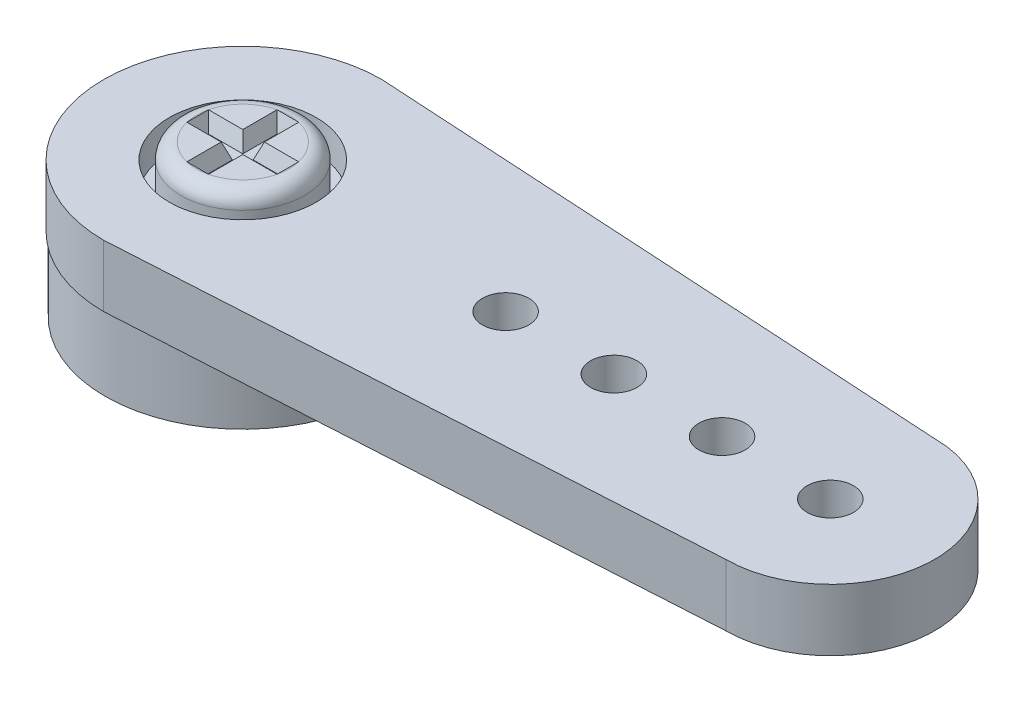
ISO-10303-21;
HEADER;
FILE_DESCRIPTION(('STEP AP214'),'2;1');
FILE_NAME('part.step','',(''),(''),'','','');
FILE_SCHEMA(('AUTOMOTIVE_DESIGN { 1 0 10303 214 1 1 1 1 }'));
ENDSEC;
DATA;
#1=APPLICATION_CONTEXT('core data for automotive mechanical design processes');
#2=APPLICATION_PROTOCOL_DEFINITION('international standard','automotive_design',2000,#1);
#3=PRODUCT_CONTEXT('',#1,'mechanical');
#4=PRODUCT('Part','Part','',(#3));
#5=PRODUCT_RELATED_PRODUCT_CATEGORY('part','',(#4));
#6=PRODUCT_DEFINITION_FORMATION('','',#4);
#7=PRODUCT_DEFINITION_CONTEXT('part definition',#1,'design');
#8=PRODUCT_DEFINITION('design','',#6,#7);
#9=PRODUCT_DEFINITION_SHAPE('','',#8);
#10=(LENGTH_UNIT() NAMED_UNIT(*) SI_UNIT(.MILLI.,.METRE.));
#11=(NAMED_UNIT(*) PLANE_ANGLE_UNIT() SI_UNIT($,.RADIAN.));
#12=(NAMED_UNIT(*) SI_UNIT($,.STERADIAN.) SOLID_ANGLE_UNIT());
#13=UNCERTAINTY_MEASURE_WITH_UNIT(LENGTH_MEASURE(1.E-05),#10,'distance_accuracy_value','');
#14=(GEOMETRIC_REPRESENTATION_CONTEXT(3) GLOBAL_UNCERTAINTY_ASSIGNED_CONTEXT((#13)) GLOBAL_UNIT_ASSIGNED_CONTEXT((#10,
#11,#12)) REPRESENTATION_CONTEXT('',''));
#15=CARTESIAN_POINT('',(0.,0.,0.));
#16=DIRECTION('',(0.,0.,1.));
#17=DIRECTION('',(1.,0.,0.));
#18=AXIS2_PLACEMENT_3D('',#15,#16,#17);
#19=CARTESIAN_POINT('',(0.,4.9,0.));
#20=DIRECTION('',(0.,1.,0.));
#21=DIRECTION('',(0.,0.,1.));
#22=AXIS2_PLACEMENT_3D('',#19,#20,#21);
#23=PLANE('',#22);
#24=DIRECTION('',(-1.,0.,0.));
#25=VECTOR('',#24,1.);
#26=CARTESIAN_POINT('',(1.45859521458148,4.9,-0.35));
#27=LINE('',#26,#25);
#28=CARTESIAN_POINT('',(1.45859521458148,4.9,-0.35));
#29=VERTEX_POINT('',#28);
#30=CARTESIAN_POINT('',(0.35,4.9,-0.35));
#31=VERTEX_POINT('',#30);
#32=EDGE_CURVE('E220',#29,#31,#27,.T.);
#33=ORIENTED_EDGE('',*,*,#32,.F.);
#34=CARTESIAN_POINT('',(0.,4.9,0.));
#35=DIRECTION('',(0.,1.,0.));
#36=DIRECTION('',(0.,0.,1.));
#37=AXIS2_PLACEMENT_3D('',#34,#35,#36);
#38=CIRCLE('',#37,1.5);
#39=CARTESIAN_POINT('',(0.35,4.9,-1.45859521458148));
#40=VERTEX_POINT('',#39);
#41=EDGE_CURVE('E184',#29,#40,#38,.T.);
#42=ORIENTED_EDGE('',*,*,#41,.T.);
#43=DIRECTION('',(0.,0.,-1.));
#44=VECTOR('',#43,1.);
#45=CARTESIAN_POINT('',(0.35,4.9,1.45859521458148));
#46=LINE('',#45,#44);
#47=EDGE_CURVE('E219',#31,#40,#46,.T.);
#48=ORIENTED_EDGE('',*,*,#47,.F.);
#49=EDGE_LOOP('',(#33,#42,#48));
#50=FACE_BOUND('',#49,.T.);
#51=ADVANCED_FACE('F73',(#50),#23,.T.);
#52=CARTESIAN_POINT('',(0.35,4.9,1.45859521458148));
#53=VERTEX_POINT('',#52);
#54=CARTESIAN_POINT('',(1.45859521458148,4.9,0.35));
#55=VERTEX_POINT('',#54);
#56=EDGE_CURVE('E81',#53,#55,#38,.T.);
#57=ORIENTED_EDGE('',*,*,#56,.T.);
#58=DIRECTION('',(-1.,0.,0.));
#59=VECTOR('',#58,1.);
#60=CARTESIAN_POINT('',(1.45859521458148,4.9,0.35));
#61=LINE('',#60,#59);
#62=CARTESIAN_POINT('',(0.35,4.9,0.35));
#63=VERTEX_POINT('',#62);
#64=EDGE_CURVE('E152',#55,#63,#61,.T.);
#65=ORIENTED_EDGE('',*,*,#64,.T.);
#66=EDGE_CURVE('E292',#53,#63,#46,.T.);
#67=ORIENTED_EDGE('',*,*,#66,.F.);
#68=EDGE_LOOP('',(#57,#65,#67));
#69=FACE_BOUND('',#68,.T.);
#70=ADVANCED_FACE('F337',(#69),#23,.T.);
#71=DIRECTION('',(0.,0.,-1.));
#72=VECTOR('',#71,1.);
#73=CARTESIAN_POINT('',(1.45859521458148,4.9,0.35));
#74=LINE('',#73,#72);
#75=EDGE_CURVE('E135',#55,#29,#74,.T.);
#76=ORIENTED_EDGE('',*,*,#75,.F.);
#77=EDGE_CURVE('E179',#55,#29,#38,.T.);
#78=ORIENTED_EDGE('',*,*,#77,.T.);
#79=EDGE_LOOP('',(#76,#78));
#80=FACE_BOUND('',#79,.T.);
#81=ADVANCED_FACE('F225',(#80),#23,.T.);
#82=CARTESIAN_POINT('',(-0.35,4.9,-0.35));
#83=VERTEX_POINT('',#82);
#84=CARTESIAN_POINT('',(-1.45859521458148,4.9,-0.35));
#85=VERTEX_POINT('',#84);
#86=EDGE_CURVE('E226',#83,#85,#27,.T.);
#87=ORIENTED_EDGE('',*,*,#86,.F.);
#88=DIRECTION('',(0.,0.,-1.));
#89=VECTOR('',#88,1.);
#90=CARTESIAN_POINT('',(-0.35,4.9,1.45859521458148));
#91=LINE('',#90,#89);
#92=CARTESIAN_POINT('',(-0.35,4.9,-1.45859521458148));
#93=VERTEX_POINT('',#92);
#94=EDGE_CURVE('E88',#83,#93,#91,.T.);
#95=ORIENTED_EDGE('',*,*,#94,.T.);
#96=EDGE_CURVE('E198',#93,#85,#38,.T.);
#97=ORIENTED_EDGE('',*,*,#96,.T.);
#98=EDGE_LOOP('',(#87,#95,#97));
#99=FACE_BOUND('',#98,.T.);
#100=ADVANCED_FACE('F345',(#99),#23,.T.);
#101=CARTESIAN_POINT('',(-0.35,4.9,1.45859521458148));
#102=VERTEX_POINT('',#101);
#103=EDGE_CURVE('E177',#102,#53,#38,.T.);
#104=ORIENTED_EDGE('',*,*,#103,.T.);
#105=DIRECTION('',(-1.,0.,0.));
#106=VECTOR('',#105,1.);
#107=CARTESIAN_POINT('',(0.35,4.9,1.45859521458148));
#108=LINE('',#107,#106);
#109=EDGE_CURVE('E236',#53,#102,#108,.T.);
#110=ORIENTED_EDGE('',*,*,#109,.T.);
#111=EDGE_LOOP('',(#104,#110));
#112=FACE_BOUND('',#111,.T.);
#113=ADVANCED_FACE('F313',(#112),#23,.T.);
#114=CARTESIAN_POINT('',(-1.45859521458148,4.9,0.35));
#115=VERTEX_POINT('',#114);
#116=EDGE_CURVE('E186',#115,#102,#38,.T.);
#117=ORIENTED_EDGE('',*,*,#116,.T.);
#118=CARTESIAN_POINT('',(-0.35,4.9,0.35));
#119=VERTEX_POINT('',#118);
#120=EDGE_CURVE('E252',#102,#119,#91,.T.);
#121=ORIENTED_EDGE('',*,*,#120,.T.);
#122=EDGE_CURVE('E155',#119,#115,#61,.T.);
#123=ORIENTED_EDGE('',*,*,#122,.T.);
#124=EDGE_LOOP('',(#117,#121,#123));
#125=FACE_BOUND('',#124,.T.);
#126=ADVANCED_FACE('F250',(#125),#23,.T.);
#127=EDGE_CURVE('E192',#85,#115,#38,.T.);
#128=ORIENTED_EDGE('',*,*,#127,.T.);
#129=DIRECTION('',(0.,0.,-1.));
#130=VECTOR('',#129,1.);
#131=CARTESIAN_POINT('',(-1.45859521458148,4.9,0.35));
#132=LINE('',#131,#130);
#133=EDGE_CURVE('E233',#115,#85,#132,.T.);
#134=ORIENTED_EDGE('',*,*,#133,.T.);
#135=EDGE_LOOP('',(#128,#134));
#136=FACE_BOUND('',#135,.T.);
#137=ADVANCED_FACE('F327',(#136),#23,.T.);
#138=CARTESIAN_POINT('',(0.,4.9,0.));
#139=DIRECTION('',(0.,-1.,0.));
#140=DIRECTION('',(0.,0.,-1.));
#141=AXIS2_PLACEMENT_3D('',#138,#139,#140);
#142=CYLINDRICAL_SURFACE('',#141,2.);
#143=CARTESIAN_POINT('',(0.,4.4,0.));
#144=DIRECTION('',(0.,1.,0.));
#145=DIRECTION('',(0.,0.,1.));
#146=AXIS2_PLACEMENT_3D('',#143,#144,#145);
#147=CIRCLE('',#146,2.);
#148=CARTESIAN_POINT('',(0.,4.4,2.));
#149=VERTEX_POINT('',#148);
#150=EDGE_CURVE('E13',#149,#149,#147,.F.);
#151=ORIENTED_EDGE('',*,*,#150,.T.);
#152=EDGE_LOOP('',(#151));
#153=FACE_BOUND('',#152,.T.);
#154=CARTESIAN_POINT('',(0.,3.4,0.));
#155=DIRECTION('',(0.,1.,0.));
#156=DIRECTION('',(0.,0.,1.));
#157=AXIS2_PLACEMENT_3D('',#154,#155,#156);
#158=CIRCLE('',#157,2.);
#159=CARTESIAN_POINT('',(0.,3.4,2.));
#160=VERTEX_POINT('',#159);
#161=EDGE_CURVE('E175',#160,#160,#158,.T.);
#162=ORIENTED_EDGE('',*,*,#161,.T.);
#163=EDGE_LOOP('',(#162));
#164=FACE_BOUND('',#163,.T.);
#165=ADVANCED_FACE('F325',(#153,#164),#142,.T.);
#166=DIRECTION('',(-1.,0.,0.));
#167=VECTOR('',#166,1.);
#168=CARTESIAN_POINT('',(0.35,4.9,-1.45859521458148));
#169=LINE('',#168,#167);
#170=EDGE_CURVE('E317',#40,#93,#169,.T.);
#171=ORIENTED_EDGE('',*,*,#170,.F.);
#172=EDGE_CURVE('E203',#40,#93,#38,.T.);
#173=ORIENTED_EDGE('',*,*,#172,.T.);
#174=EDGE_LOOP('',(#171,#173));
#175=FACE_BOUND('',#174,.T.);
#176=ADVANCED_FACE('F322',(#175),#23,.T.);
#177=CARTESIAN_POINT('',(0.,3.4,0.));
#178=DIRECTION('',(0.,1.,0.));
#179=DIRECTION('',(0.,0.,1.));
#180=AXIS2_PLACEMENT_3D('',#177,#178,#179);
#181=PLANE('',#180);
#182=ORIENTED_EDGE('',*,*,#161,.F.);
#183=EDGE_LOOP('',(#182));
#184=FACE_BOUND('',#183,.T.);
#185=ADVANCED_FACE('F324',(#184),#181,.F.);
#186=CARTESIAN_POINT('',(0.,4.4,0.));
#187=DIRECTION('',(0.,1.,0.));
#188=DIRECTION('',(0.,0.,1.));
#189=AXIS2_PLACEMENT_3D('',#186,#187,#188);
#190=TOROIDAL_SURFACE('',#189,1.5,0.5);
#191=ORIENTED_EDGE('',*,*,#150,.F.);
#192=EDGE_LOOP('',(#191));
#193=FACE_BOUND('',#192,.T.);
#194=ORIENTED_EDGE('',*,*,#56,.F.);
#195=ORIENTED_EDGE('',*,*,#103,.F.);
#196=ORIENTED_EDGE('',*,*,#116,.F.);
#197=ORIENTED_EDGE('',*,*,#127,.F.);
#198=ORIENTED_EDGE('',*,*,#96,.F.);
#199=ORIENTED_EDGE('',*,*,#172,.F.);
#200=ORIENTED_EDGE('',*,*,#41,.F.);
#201=ORIENTED_EDGE('',*,*,#77,.F.);
#202=EDGE_LOOP('',(#194,#195,#196,#197,#198,#199,#200,#201));
#203=FACE_BOUND('',#202,.T.);
#204=ADVANCED_FACE('F75',(#193,#203),#190,.T.);
#205=CARTESIAN_POINT('',(0.35,4.9,-1.45859521458148));
#206=DIRECTION('',(0.,-0.342020143325669,-0.939692620785908));
#207=DIRECTION('',(0.,0.939692620785908,-0.342020143325669));
#208=AXIS2_PLACEMENT_3D('',#205,#206,#207);
#209=PLANE('',#208);
#210=ORIENTED_EDGE('',*,*,#170,.T.);
#211=DIRECTION('',(0.323615577118185,-0.889126490715988,0.323615577118185));
#212=VECTOR('',#211,1.);
#213=CARTESIAN_POINT('',(-0.0444912761220343,4.06062167969889,-1.15308649070352));
#214=LINE('',#213,#212);
#215=CARTESIAN_POINT('',(-0.168014882866898,4.4,-1.27661009744838));
#216=VERTEX_POINT('',#215);
#217=EDGE_CURVE('E306',#216,#93,#214,.F.);
#218=ORIENTED_EDGE('',*,*,#217,.F.);
#219=DIRECTION('',(-1.,0.,0.));
#220=VECTOR('',#219,1.);
#221=CARTESIAN_POINT('',(0.35,4.4,-1.27661009744838));
#222=LINE('',#221,#220);
#223=CARTESIAN_POINT('',(0.168014882866898,4.4,-1.27661009744838));
#224=VERTEX_POINT('',#223);
#225=EDGE_CURVE('E286',#224,#216,#222,.T.);
#226=ORIENTED_EDGE('',*,*,#225,.F.);
#227=DIRECTION('',(0.323615577118185,0.889126490715988,-0.323615577118185));
#228=VECTOR('',#227,1.);
#229=CARTESIAN_POINT('',(0.0444912761220341,4.06062167969889,-1.15308649070352));
#230=LINE('',#229,#228);
#231=EDGE_CURVE('E300',#224,#40,#230,.T.);
#232=ORIENTED_EDGE('',*,*,#231,.T.);
#233=EDGE_LOOP('',(#210,#218,#226,#232));
#234=FACE_BOUND('',#233,.T.);
#235=ADVANCED_FACE('F321',(#234),#209,.F.);
#236=CARTESIAN_POINT('',(0.35,4.9,1.45859521458148));
#237=DIRECTION('',(0.939692620785908,-0.342020143325669,0.));
#238=DIRECTION('',(0.342020143325669,0.939692620785908,0.));
#239=AXIS2_PLACEMENT_3D('',#236,#237,#238);
#240=PLANE('',#239);
#241=DIRECTION('',(0.323615577118185,0.889126490715988,-0.323615577118185));
#242=VECTOR('',#241,1.);
#243=CARTESIAN_POINT('',(0.160591173447279,4.379603526001,-0.16059117344728));
#244=LINE('',#243,#242);
#245=CARTESIAN_POINT('',(0.168014882866898,4.4,-0.168014882866898));
#246=VERTEX_POINT('',#245);
#247=EDGE_CURVE('E97',#246,#31,#244,.T.);
#248=ORIENTED_EDGE('',*,*,#247,.T.);
#249=ORIENTED_EDGE('',*,*,#47,.T.);
#250=ORIENTED_EDGE('',*,*,#231,.F.);
#251=DIRECTION('',(0.,0.,-1.));
#252=VECTOR('',#251,1.);
#253=CARTESIAN_POINT('',(0.168014882866898,4.4,1.45859521458148));
#254=LINE('',#253,#252);
#255=EDGE_CURVE('E295',#246,#224,#254,.T.);
#256=ORIENTED_EDGE('',*,*,#255,.F.);
#257=EDGE_LOOP('',(#248,#249,#250,#256));
#258=FACE_BOUND('',#257,.T.);
#259=ADVANCED_FACE('F319',(#258),#240,.F.);
#260=CARTESIAN_POINT('',(-0.35,4.9,1.45859521458148));
#261=DIRECTION('',(-0.939692620785908,-0.342020143325669,0.));
#262=DIRECTION('',(0.342020143325669,-0.939692620785908,0.));
#263=AXIS2_PLACEMENT_3D('',#260,#261,#262);
#264=PLANE('',#263);
#265=DIRECTION('',(0.,0.,1.));
#266=VECTOR('',#265,1.);
#267=CARTESIAN_POINT('',(-0.168014882866898,4.4,1.45859521458148));
#268=LINE('',#267,#266);
#269=CARTESIAN_POINT('',(-0.168014882866898,4.4,-0.168014882866898));
#270=VERTEX_POINT('',#269);
#271=EDGE_CURVE('E280',#270,#216,#268,.F.);
#272=ORIENTED_EDGE('',*,*,#271,.T.);
#273=ORIENTED_EDGE('',*,*,#217,.T.);
#274=ORIENTED_EDGE('',*,*,#94,.F.);
#275=DIRECTION('',(0.323615577118185,-0.889126490715988,0.323615577118185));
#276=VECTOR('',#275,1.);
#277=CARTESIAN_POINT('',(-0.16059117344728,4.379603526001,-0.16059117344728));
#278=LINE('',#277,#276);
#279=EDGE_CURVE('E168',#270,#83,#278,.F.);
#280=ORIENTED_EDGE('',*,*,#279,.F.);
#281=EDGE_LOOP('',(#272,#273,#274,#280));
#282=FACE_BOUND('',#281,.T.);
#283=ADVANCED_FACE('F278',(#282),#264,.F.);
#284=CARTESIAN_POINT('',(0.,4.4,0.));
#285=DIRECTION('',(0.,-1.,0.));
#286=DIRECTION('',(0.,0.,-1.));
#287=AXIS2_PLACEMENT_3D('',#284,#285,#286);
#288=PLANE('',#287);
#289=ORIENTED_EDGE('',*,*,#255,.T.);
#290=ORIENTED_EDGE('',*,*,#225,.T.);
#291=ORIENTED_EDGE('',*,*,#271,.F.);
#292=DIRECTION('',(-1.,0.,0.));
#293=VECTOR('',#292,1.);
#294=CARTESIAN_POINT('',(0.,4.4,-0.168014882866898));
#295=LINE('',#294,#293);
#296=CARTESIAN_POINT('',(-1.27661009744838,4.4,-0.168014882866898));
#297=VERTEX_POINT('',#296);
#298=EDGE_CURVE('E146',#270,#297,#295,.T.);
#299=ORIENTED_EDGE('',*,*,#298,.T.);
#300=DIRECTION('',(0.,0.,1.));
#301=VECTOR('',#300,1.);
#302=CARTESIAN_POINT('',(-1.27661009744838,4.4,0.));
#303=LINE('',#302,#301);
#304=CARTESIAN_POINT('',(-1.27661009744838,4.4,0.168014882866898));
#305=VERTEX_POINT('',#304);
#306=EDGE_CURVE('E145',#305,#297,#303,.F.);
#307=ORIENTED_EDGE('',*,*,#306,.F.);
#308=DIRECTION('',(1.,0.,0.));
#309=VECTOR('',#308,1.);
#310=CARTESIAN_POINT('',(0.,4.4,0.168014882866898));
#311=LINE('',#310,#309);
#312=CARTESIAN_POINT('',(-0.168014882866898,4.4,0.168014882866898));
#313=VERTEX_POINT('',#312);
#314=EDGE_CURVE('E162',#313,#305,#311,.F.);
#315=ORIENTED_EDGE('',*,*,#314,.F.);
#316=CARTESIAN_POINT('',(-0.168014882866898,4.4,1.27661009744838));
#317=VERTEX_POINT('',#316);
#318=EDGE_CURVE('E287',#317,#313,#268,.F.);
#319=ORIENTED_EDGE('',*,*,#318,.F.);
#320=DIRECTION('',(1.,0.,0.));
#321=VECTOR('',#320,1.);
#322=CARTESIAN_POINT('',(0.35,4.4,1.27661009744838));
#323=LINE('',#322,#321);
#324=CARTESIAN_POINT('',(0.168014882866898,4.4,1.27661009744838));
#325=VERTEX_POINT('',#324);
#326=EDGE_CURVE('E288',#325,#317,#323,.F.);
#327=ORIENTED_EDGE('',*,*,#326,.F.);
#328=CARTESIAN_POINT('',(0.168014882866898,4.4,0.168014882866898));
#329=VERTEX_POINT('',#328);
#330=EDGE_CURVE('E230',#325,#329,#254,.T.);
#331=ORIENTED_EDGE('',*,*,#330,.T.);
#332=CARTESIAN_POINT('',(1.27661009744838,4.4,0.168014882866898));
#333=VERTEX_POINT('',#332);
#334=EDGE_CURVE('E138',#333,#329,#311,.F.);
#335=ORIENTED_EDGE('',*,*,#334,.F.);
#336=DIRECTION('',(0.,0.,-1.));
#337=VECTOR('',#336,1.);
#338=CARTESIAN_POINT('',(1.27661009744838,4.4,0.));
#339=LINE('',#338,#337);
#340=CARTESIAN_POINT('',(1.27661009744838,4.4,-0.168014882866898));
#341=VERTEX_POINT('',#340);
#342=EDGE_CURVE('E133',#333,#341,#339,.T.);
#343=ORIENTED_EDGE('',*,*,#342,.T.);
#344=EDGE_CURVE('E140',#341,#246,#295,.T.);
#345=ORIENTED_EDGE('',*,*,#344,.T.);
#346=EDGE_LOOP('',(#289,#290,#291,#299,#307,#315,#319,#327,#331,#335,#343,#345));
#347=FACE_BOUND('',#346,.T.);
#348=ADVANCED_FACE('F149',(#347),#288,.F.);
#349=ORIENTED_EDGE('',*,*,#330,.F.);
#350=DIRECTION('',(-0.323615577118185,-0.889126490715988,-0.323615577118185));
#351=VECTOR('',#350,1.);
#352=CARTESIAN_POINT('',(0.35,4.9,1.45859521458148));
#353=LINE('',#352,#351);
#354=EDGE_CURVE('E297',#325,#53,#353,.F.);
#355=ORIENTED_EDGE('',*,*,#354,.T.);
#356=ORIENTED_EDGE('',*,*,#66,.T.);
#357=DIRECTION('',(-0.323615577118185,-0.889126490715988,-0.323615577118185));
#358=VECTOR('',#357,1.);
#359=CARTESIAN_POINT('',(0.466099897325245,5.21898184630211,0.466099897325245));
#360=LINE('',#359,#358);
#361=EDGE_CURVE('E166',#329,#63,#360,.F.);
#362=ORIENTED_EDGE('',*,*,#361,.F.);
#363=EDGE_LOOP('',(#349,#355,#356,#362));
#364=FACE_BOUND('',#363,.T.);
#365=ADVANCED_FACE('F395',(#364),#240,.F.);
#366=CARTESIAN_POINT('',(0.35,4.9,1.45859521458148));
#367=DIRECTION('',(0.,-0.342020143325669,0.939692620785908));
#368=DIRECTION('',(0.,-0.939692620785908,-0.342020143325669));
#369=AXIS2_PLACEMENT_3D('',#366,#367,#368);
#370=PLANE('',#369);
#371=ORIENTED_EDGE('',*,*,#109,.F.);
#372=ORIENTED_EDGE('',*,*,#354,.F.);
#373=ORIENTED_EDGE('',*,*,#326,.T.);
#374=DIRECTION('',(-0.323615577118185,0.889126490715988,0.323615577118185));
#375=VECTOR('',#374,1.);
#376=CARTESIAN_POINT('',(-0.35,4.9,1.45859521458148));
#377=LINE('',#376,#375);
#378=EDGE_CURVE('E167',#317,#102,#377,.T.);
#379=ORIENTED_EDGE('',*,*,#378,.T.);
#380=EDGE_LOOP('',(#371,#372,#373,#379));
#381=FACE_BOUND('',#380,.T.);
#382=ADVANCED_FACE('F312',(#381),#370,.F.);
#383=DIRECTION('',(-0.323615577118185,0.889126490715988,0.323615577118185));
#384=VECTOR('',#383,1.);
#385=CARTESIAN_POINT('',(-0.466099897325245,5.21898184630211,0.466099897325245));
#386=LINE('',#385,#384);
#387=EDGE_CURVE('E170',#313,#119,#386,.T.);
#388=ORIENTED_EDGE('',*,*,#387,.T.);
#389=ORIENTED_EDGE('',*,*,#120,.F.);
#390=ORIENTED_EDGE('',*,*,#378,.F.);
#391=ORIENTED_EDGE('',*,*,#318,.T.);
#392=EDGE_LOOP('',(#388,#389,#390,#391));
#393=FACE_BOUND('',#392,.T.);
#394=ADVANCED_FACE('F402',(#393),#264,.F.);
#395=CARTESIAN_POINT('',(1.45859521458148,4.9,0.35));
#396=DIRECTION('',(0.939692620785908,-0.342020143325669,0.));
#397=DIRECTION('',(0.342020143325669,0.939692620785908,0.));
#398=AXIS2_PLACEMENT_3D('',#395,#396,#397);
#399=PLANE('',#398);
#400=ORIENTED_EDGE('',*,*,#75,.T.);
#401=DIRECTION('',(0.323615577118185,0.889126490715988,-0.323615577118185));
#402=VECTOR('',#401,1.);
#403=CARTESIAN_POINT('',(1.38528628535401,4.69858537230312,-0.276691070772525));
#404=LINE('',#403,#402);
#405=EDGE_CURVE('E130',#341,#29,#404,.T.);
#406=ORIENTED_EDGE('',*,*,#405,.F.);
#407=ORIENTED_EDGE('',*,*,#342,.F.);
#408=DIRECTION('',(-0.323615577118185,-0.889126490715988,-0.323615577118185));
#409=VECTOR('',#408,1.);
#410=CARTESIAN_POINT('',(1.45859521458148,4.9,0.35));
#411=LINE('',#410,#409);
#412=EDGE_CURVE('E235',#333,#55,#411,.F.);
#413=ORIENTED_EDGE('',*,*,#412,.T.);
#414=EDGE_LOOP('',(#400,#406,#407,#413));
#415=FACE_BOUND('',#414,.T.);
#416=ADVANCED_FACE('F131',(#415),#399,.F.);
#417=CARTESIAN_POINT('',(1.45859521458148,4.9,0.35));
#418=DIRECTION('',(0.,-0.342020143325669,0.939692620785908));
#419=DIRECTION('',(0.,-0.939692620785908,-0.342020143325669));
#420=AXIS2_PLACEMENT_3D('',#417,#418,#419);
#421=PLANE('',#420);
#422=ORIENTED_EDGE('',*,*,#361,.T.);
#423=ORIENTED_EDGE('',*,*,#64,.F.);
#424=ORIENTED_EDGE('',*,*,#412,.F.);
#425=ORIENTED_EDGE('',*,*,#334,.T.);
#426=EDGE_LOOP('',(#422,#423,#424,#425));
#427=FACE_BOUND('',#426,.T.);
#428=ADVANCED_FACE('F430',(#427),#421,.F.);
#429=CARTESIAN_POINT('',(1.45859521458148,4.9,-0.35));
#430=DIRECTION('',(0.,-0.342020143325669,-0.939692620785908));
#431=DIRECTION('',(0.,0.939692620785908,-0.342020143325669));
#432=AXIS2_PLACEMENT_3D('',#429,#430,#431);
#433=PLANE('',#432);
#434=ORIENTED_EDGE('',*,*,#344,.F.);
#435=ORIENTED_EDGE('',*,*,#405,.T.);
#436=ORIENTED_EDGE('',*,*,#32,.T.);
#437=ORIENTED_EDGE('',*,*,#247,.F.);
#438=EDGE_LOOP('',(#434,#435,#436,#437));
#439=FACE_BOUND('',#438,.T.);
#440=ADVANCED_FACE('F141',(#439),#433,.F.);
#441=ORIENTED_EDGE('',*,*,#314,.T.);
#442=DIRECTION('',(-0.323615577118185,0.889126490715988,0.323615577118185));
#443=VECTOR('',#442,1.);
#444=CARTESIAN_POINT('',(-1.45859521458148,4.9,0.35));
#445=LINE('',#444,#443);
#446=EDGE_CURVE('E159',#305,#115,#445,.T.);
#447=ORIENTED_EDGE('',*,*,#446,.T.);
#448=ORIENTED_EDGE('',*,*,#122,.F.);
#449=ORIENTED_EDGE('',*,*,#387,.F.);
#450=EDGE_LOOP('',(#441,#447,#448,#449));
#451=FACE_BOUND('',#450,.T.);
#452=ADVANCED_FACE('F244',(#451),#421,.F.);
#453=CARTESIAN_POINT('',(-1.45859521458148,4.9,0.35));
#454=DIRECTION('',(-0.939692620785908,-0.342020143325669,0.));
#455=DIRECTION('',(0.342020143325669,-0.939692620785908,0.));
#456=AXIS2_PLACEMENT_3D('',#453,#454,#455);
#457=PLANE('',#456);
#458=ORIENTED_EDGE('',*,*,#133,.F.);
#459=ORIENTED_EDGE('',*,*,#446,.F.);
#460=ORIENTED_EDGE('',*,*,#306,.T.);
#461=DIRECTION('',(0.323615577118185,-0.889126490715988,0.323615577118185));
#462=VECTOR('',#461,1.);
#463=CARTESIAN_POINT('',(-1.38528628535401,4.69858537230312,-0.276691070772525));
#464=LINE('',#463,#462);
#465=EDGE_CURVE('E137',#297,#85,#464,.F.);
#466=ORIENTED_EDGE('',*,*,#465,.T.);
#467=EDGE_LOOP('',(#458,#459,#460,#466));
#468=FACE_BOUND('',#467,.T.);
#469=ADVANCED_FACE('F249',(#468),#457,.F.);
#470=ORIENTED_EDGE('',*,*,#279,.T.);
#471=ORIENTED_EDGE('',*,*,#86,.T.);
#472=ORIENTED_EDGE('',*,*,#465,.F.);
#473=ORIENTED_EDGE('',*,*,#298,.F.);
#474=EDGE_LOOP('',(#470,#471,#472,#473));
#475=FACE_BOUND('',#474,.T.);
#476=ADVANCED_FACE('F283',(#475),#433,.F.);
#477=CLOSED_SHELL('',(#51,#70,#81,#100,#113,#126,#137,#165,#176,#185,#204,#235,#259,#283,#348,
#365,#382,#394,#416,#428,#440,#452,#469,#476));
#478=MANIFOLD_SOLID_BREP('B2',#477);
#479=CARTESIAN_POINT('',(0.,4.4,0.));
#480=DIRECTION('',(0.,-1.,0.));
#481=DIRECTION('',(0.,0.,-1.));
#482=AXIS2_PLACEMENT_3D('',#479,#480,#481);
#483=CYLINDRICAL_SURFACE('',#482,1.);
#484=CARTESIAN_POINT('',(0.,3.4,0.));
#485=DIRECTION('',(0.,1.,0.));
#486=DIRECTION('',(0.,0.,1.));
#487=AXIS2_PLACEMENT_3D('',#484,#485,#486);
#488=CIRCLE('',#487,1.);
#489=CARTESIAN_POINT('',(0.,3.4,1.));
#490=VERTEX_POINT('',#489);
#491=EDGE_CURVE('E620',#490,#490,#488,.T.);
#492=ORIENTED_EDGE('',*,*,#491,.T.);
#493=EDGE_LOOP('',(#492));
#494=FACE_BOUND('',#493,.T.);
#495=CARTESIAN_POINT('',(0.,3.,0.));
#496=DIRECTION('',(0.,-1.,0.));
#497=DIRECTION('',(0.,0.,-1.));
#498=AXIS2_PLACEMENT_3D('',#495,#496,#497);
#499=CIRCLE('',#498,1.);
#500=CARTESIAN_POINT('',(0.,3.,-1.));
#501=VERTEX_POINT('',#500);
#502=EDGE_CURVE('E525',#501,#501,#499,.T.);
#503=ORIENTED_EDGE('',*,*,#502,.T.);
#504=EDGE_LOOP('',(#503));
#505=FACE_BOUND('',#504,.T.);
#506=ADVANCED_FACE('F521',(#494,#505),#483,.F.);
#507=CARTESIAN_POINT('',(0.,4.4,0.));
#508=DIRECTION('',(0.,-1.,0.));
#509=DIRECTION('',(0.,0.,-1.));
#510=AXIS2_PLACEMENT_3D('',#507,#508,#509);
#511=CYLINDRICAL_SURFACE('',#510,4.45);
#512=CARTESIAN_POINT('',(0.,0.,0.));
#513=DIRECTION('',(0.,1.,0.));
#514=DIRECTION('',(0.,0.,1.));
#515=AXIS2_PLACEMENT_3D('',#512,#513,#514);
#516=CIRCLE('',#515,4.45);
#517=CARTESIAN_POINT('',(0.,0.,4.45));
#518=VERTEX_POINT('',#517);
#519=EDGE_CURVE('E530',#518,#518,#516,.T.);
#520=ORIENTED_EDGE('',*,*,#519,.T.);
#521=EDGE_LOOP('',(#520));
#522=FACE_BOUND('',#521,.T.);
#523=CARTESIAN_POINT('',(0.,2.4,0.));
#524=DIRECTION('',(0.,1.,0.));
#525=DIRECTION('',(0.,0.,1.));
#526=AXIS2_PLACEMENT_3D('',#523,#524,#525);
#527=CIRCLE('',#526,4.45);
#528=CARTESIAN_POINT('',(0.,2.4,4.45));
#529=VERTEX_POINT('',#528);
#530=EDGE_CURVE('E71',#529,#529,#527,.T.);
#531=ORIENTED_EDGE('',*,*,#530,.F.);
#532=EDGE_LOOP('',(#531));
#533=FACE_BOUND('',#532,.T.);
#534=ADVANCED_FACE('F523',(#522,#533),#511,.T.);
#535=CARTESIAN_POINT('',(0.,4.4,0.));
#536=DIRECTION('',(0.,1.,0.));
#537=DIRECTION('',(0.,0.,1.));
#538=AXIS2_PLACEMENT_3D('',#535,#536,#537);
#539=PLANE('',#538);
#540=CARTESIAN_POINT('',(0.,4.4,0.));
#541=DIRECTION('',(0.,1.,0.));
#542=DIRECTION('',(0.,0.,1.));
#543=AXIS2_PLACEMENT_3D('',#540,#541,#542);
#544=CIRCLE('',#543,2.375);
#545=CARTESIAN_POINT('',(0.,4.4,2.375));
#546=VERTEX_POINT('',#545);
#547=EDGE_CURVE('E632',#546,#546,#544,.T.);
#548=ORIENTED_EDGE('',*,*,#547,.F.);
#549=EDGE_LOOP('',(#548));
#550=FACE_BOUND('',#549,.T.);
#551=CARTESIAN_POINT('',(19.,4.4,0.));
#552=DIRECTION('',(0.,1.,0.));
#553=DIRECTION('',(0.,0.,1.));
#554=AXIS2_PLACEMENT_3D('',#551,#552,#553);
#555=CIRCLE('',#554,0.750000000000002);
#556=CARTESIAN_POINT('',(19.,4.4,0.750000000000002));
#557=VERTEX_POINT('',#556);
#558=EDGE_CURVE('E612',#557,#557,#555,.T.);
#559=ORIENTED_EDGE('',*,*,#558,.F.);
#560=EDGE_LOOP('',(#559));
#561=FACE_BOUND('',#560,.T.);
#562=CARTESIAN_POINT('',(15.5,4.4,0.));
#563=DIRECTION('',(0.,1.,0.));
#564=DIRECTION('',(0.,0.,1.));
#565=AXIS2_PLACEMENT_3D('',#562,#563,#564);
#566=CIRCLE('',#565,0.750000000000002);
#567=CARTESIAN_POINT('',(15.5,4.4,0.750000000000026));
#568=VERTEX_POINT('',#567);
#569=EDGE_CURVE('E609',#568,#568,#566,.T.);
#570=ORIENTED_EDGE('',*,*,#569,.F.);
#571=EDGE_LOOP('',(#570));
#572=FACE_BOUND('',#571,.T.);
#573=CARTESIAN_POINT('',(12.,4.4,0.));
#574=DIRECTION('',(0.,1.,0.));
#575=DIRECTION('',(0.,0.,1.));
#576=AXIS2_PLACEMENT_3D('',#573,#574,#575);
#577=CIRCLE('',#576,0.750000000000002);
#578=CARTESIAN_POINT('',(12.,4.4,0.750000000000051));
#579=VERTEX_POINT('',#578);
#580=EDGE_CURVE('E606',#579,#579,#577,.T.);
#581=ORIENTED_EDGE('',*,*,#580,.F.);
#582=EDGE_LOOP('',(#581));
#583=FACE_BOUND('',#582,.T.);
#584=CARTESIAN_POINT('',(8.5,4.4,0.));
#585=DIRECTION('',(0.,1.,0.));
#586=DIRECTION('',(0.,0.,1.));
#587=AXIS2_PLACEMENT_3D('',#584,#585,#586);
#588=CIRCLE('',#587,0.750000000000002);
#589=CARTESIAN_POINT('',(8.5,4.4,0.750000000000075));
#590=VERTEX_POINT('',#589);
#591=EDGE_CURVE('E603',#590,#590,#588,.T.);
#592=ORIENTED_EDGE('',*,*,#591,.F.);
#593=EDGE_LOOP('',(#592));
#594=FACE_BOUND('',#593,.T.);
#595=DIRECTION('',(0.99826509847011,0.,0.058879480096737));
#596=VECTOR('',#595,1.);
#597=CARTESIAN_POINT('',(0.264497984984871,4.4,-4.48439943070592));
#598=LINE('',#597,#596);
#599=CARTESIAN_POINT('',(0.,4.40000000000001,-4.5));
#600=VERTEX_POINT('',#599);
#601=CARTESIAN_POINT('',(19.,4.4,-3.37934565322127));
#602=VERTEX_POINT('',#601);
#603=EDGE_CURVE('E574',#600,#602,#598,.T.);
#604=ORIENTED_EDGE('',*,*,#603,.F.);
#605=CARTESIAN_POINT('',(0.,4.4,0.));
#606=DIRECTION('',(0.,1.,0.));
#607=DIRECTION('',(0.,0.,1.));
#608=AXIS2_PLACEMENT_3D('',#605,#606,#607);
#609=CIRCLE('',#608,4.5);
#610=CARTESIAN_POINT('',(0.,4.40000000000001,4.5));
#611=VERTEX_POINT('',#610);
#612=EDGE_CURVE('E567',#600,#611,#609,.T.);
#613=ORIENTED_EDGE('',*,*,#612,.T.);
#614=DIRECTION('',(0.99826509847011,0.,-0.0588794800967397));
#615=VECTOR('',#614,1.);
#616=CARTESIAN_POINT('',(0.264497984984883,4.4,4.48439943070592));
#617=LINE('',#616,#615);
#618=CARTESIAN_POINT('',(19.,4.40000000000001,3.37934565322124));
#619=VERTEX_POINT('',#618);
#620=EDGE_CURVE('E588',#611,#619,#617,.T.);
#621=ORIENTED_EDGE('',*,*,#620,.T.);
#622=CARTESIAN_POINT('',(19.,4.4,0.));
#623=DIRECTION('',(0.,1.,0.));
#624=DIRECTION('',(0.,0.,1.));
#625=AXIS2_PLACEMENT_3D('',#622,#623,#624);
#626=CIRCLE('',#625,3.37934565322127);
#627=EDGE_CURVE('E617',#619,#602,#626,.T.);
#628=ORIENTED_EDGE('',*,*,#627,.T.);
#629=EDGE_LOOP('',(#604,#613,#621,#628));
#630=FACE_BOUND('',#629,.T.);
#631=ADVANCED_FACE('F645',(#550,#561,#572,#583,#594,#630),#539,.T.);
#632=CARTESIAN_POINT('',(0.,0.,0.));
#633=DIRECTION('',(0.,1.,0.));
#634=DIRECTION('',(0.,0.,1.));
#635=AXIS2_PLACEMENT_3D('',#632,#633,#634);
#636=PLANE('',#635);
#637=CARTESIAN_POINT('',(0.,0.,0.));
#638=DIRECTION('',(0.,-1.,0.));
#639=DIRECTION('',(0.,0.,-1.));
#640=AXIS2_PLACEMENT_3D('',#637,#638,#639);
#641=CIRCLE('',#640,2.905);
#642=CARTESIAN_POINT('',(0.,0.,-2.905));
#643=VERTEX_POINT('',#642);
#644=EDGE_CURVE('E639',#643,#643,#641,.T.);
#645=ORIENTED_EDGE('',*,*,#644,.F.);
#646=EDGE_LOOP('',(#645));
#647=FACE_BOUND('',#646,.T.);
#648=ORIENTED_EDGE('',*,*,#519,.F.);
#649=EDGE_LOOP('',(#648));
#650=FACE_BOUND('',#649,.T.);
#651=ADVANCED_FACE('F647',(#647,#650),#636,.F.);
#652=CARTESIAN_POINT('',(0.264497984984871,32.7460618560206,-4.48439943070592));
#653=DIRECTION('',(0.058879480096737,0.,-0.99826509847011));
#654=DIRECTION('',(-0.99826509847011,0.,-0.058879480096737));
#655=AXIS2_PLACEMENT_3D('',#652,#653,#654);
#656=PLANE('',#655);
#657=DIRECTION('',(0.,-1.,0.));
#658=VECTOR('',#657,1.);
#659=CARTESIAN_POINT('',(0.,32.7460618560206,-4.5));
#660=LINE('',#659,#658);
#661=CARTESIAN_POINT('',(0.,2.4,-4.5));
#662=VERTEX_POINT('',#661);
#663=EDGE_CURVE('E561',#600,#662,#660,.T.);
#664=ORIENTED_EDGE('',*,*,#663,.F.);
#665=ORIENTED_EDGE('',*,*,#603,.T.);
#666=DIRECTION('',(0.,-1.,0.));
#667=VECTOR('',#666,1.);
#668=CARTESIAN_POINT('',(19.,32.7460618560206,-3.37934565322129));
#669=LINE('',#668,#667);
#670=CARTESIAN_POINT('',(19.,2.4,-3.37934565322129));
#671=VERTEX_POINT('',#670);
#672=EDGE_CURVE('E538',#602,#671,#669,.T.);
#673=ORIENTED_EDGE('',*,*,#672,.T.);
#674=DIRECTION('',(0.99826509847011,0.,0.058879480096737));
#675=VECTOR('',#674,1.);
#676=CARTESIAN_POINT('',(0.264497984984871,2.4,-4.48439943070592));
#677=LINE('',#676,#675);
#678=EDGE_CURVE('E572',#662,#671,#677,.T.);
#679=ORIENTED_EDGE('',*,*,#678,.F.);
#680=EDGE_LOOP('',(#664,#665,#673,#679));
#681=FACE_BOUND('',#680,.T.);
#682=ADVANCED_FACE('F570',(#681),#656,.T.);
#683=CARTESIAN_POINT('',(0.,32.7460618560206,0.));
#684=DIRECTION('',(0.,-1.,0.));
#685=DIRECTION('',(0.,0.,-1.));
#686=AXIS2_PLACEMENT_3D('',#683,#684,#685);
#687=CYLINDRICAL_SURFACE('',#686,4.5);
#688=ORIENTED_EDGE('',*,*,#612,.F.);
#689=ORIENTED_EDGE('',*,*,#663,.T.);
#690=CARTESIAN_POINT('',(0.,2.4,0.));
#691=DIRECTION('',(0.,1.,0.));
#692=DIRECTION('',(0.,0.,1.));
#693=AXIS2_PLACEMENT_3D('',#690,#691,#692);
#694=CIRCLE('',#693,4.5);
#695=CARTESIAN_POINT('',(0.,2.4,4.5));
#696=VERTEX_POINT('',#695);
#697=EDGE_CURVE('E585',#662,#696,#694,.T.);
#698=ORIENTED_EDGE('',*,*,#697,.T.);
#699=DIRECTION('',(0.,-1.,0.));
#700=VECTOR('',#699,1.);
#701=CARTESIAN_POINT('',(0.,32.7460618560206,4.5));
#702=LINE('',#701,#700);
#703=EDGE_CURVE('E623',#611,#696,#702,.T.);
#704=ORIENTED_EDGE('',*,*,#703,.F.);
#705=EDGE_LOOP('',(#688,#689,#698,#704));
#706=FACE_BOUND('',#705,.T.);
#707=ADVANCED_FACE('F643',(#706),#687,.T.);
#708=CARTESIAN_POINT('',(0.264497984984883,32.7460618560206,4.48439943070592));
#709=DIRECTION('',(-0.0588794800967396,0.,-0.99826509847011));
#710=DIRECTION('',(-0.99826509847011,0.,0.0588794800967397));
#711=AXIS2_PLACEMENT_3D('',#708,#709,#710);
#712=PLANE('',#711);
#713=ORIENTED_EDGE('',*,*,#620,.F.);
#714=ORIENTED_EDGE('',*,*,#703,.T.);
#715=DIRECTION('',(0.99826509847011,0.,-0.0588794800967396));
#716=VECTOR('',#715,1.);
#717=CARTESIAN_POINT('',(0.264497984984883,2.4,4.48439943070592));
#718=LINE('',#717,#716);
#719=CARTESIAN_POINT('',(19.,2.4,3.37934565322124));
#720=VERTEX_POINT('',#719);
#721=EDGE_CURVE('E615',#696,#720,#718,.T.);
#722=ORIENTED_EDGE('',*,*,#721,.T.);
#723=DIRECTION('',(0.,-1.,0.));
#724=VECTOR('',#723,1.);
#725=CARTESIAN_POINT('',(19.,32.7460618560206,3.37934565322124));
#726=LINE('',#725,#724);
#727=EDGE_CURVE('E544',#619,#720,#726,.T.);
#728=ORIENTED_EDGE('',*,*,#727,.F.);
#729=EDGE_LOOP('',(#713,#714,#722,#728));
#730=FACE_BOUND('',#729,.T.);
#731=ADVANCED_FACE('F642',(#730),#712,.F.);
#732=CARTESIAN_POINT('',(19.,32.7460618560206,0.));
#733=DIRECTION('',(0.,-1.,0.));
#734=DIRECTION('',(0.,0.,-1.));
#735=AXIS2_PLACEMENT_3D('',#732,#733,#734);
#736=CYLINDRICAL_SURFACE('',#735,0.750000000000002);
#737=CARTESIAN_POINT('',(19.,2.4,0.));
#738=DIRECTION('',(0.,1.,0.));
#739=DIRECTION('',(0.,0.,1.));
#740=AXIS2_PLACEMENT_3D('',#737,#738,#739);
#741=CIRCLE('',#740,0.750000000000002);
#742=CARTESIAN_POINT('',(19.,2.4,0.750000000000002));
#743=VERTEX_POINT('',#742);
#744=EDGE_CURVE('E586',#743,#743,#741,.T.);
#745=ORIENTED_EDGE('',*,*,#744,.F.);
#746=EDGE_LOOP('',(#745));
#747=FACE_BOUND('',#746,.T.);
#748=ORIENTED_EDGE('',*,*,#558,.T.);
#749=EDGE_LOOP('',(#748));
#750=FACE_BOUND('',#749,.T.);
#751=ADVANCED_FACE('F696',(#747,#750),#736,.F.);
#752=CARTESIAN_POINT('',(15.5,32.7460618560206,0.));
#753=DIRECTION('',(0.,-1.,0.));
#754=DIRECTION('',(0.,0.,-1.));
#755=AXIS2_PLACEMENT_3D('',#752,#753,#754);
#756=CYLINDRICAL_SURFACE('',#755,0.750000000000002);
#757=CARTESIAN_POINT('',(15.5,2.4,0.));
#758=DIRECTION('',(0.,1.,0.));
#759=DIRECTION('',(0.,0.,1.));
#760=AXIS2_PLACEMENT_3D('',#757,#758,#759);
#761=CIRCLE('',#760,0.750000000000002);
#762=CARTESIAN_POINT('',(15.5,2.4,0.750000000000026));
#763=VERTEX_POINT('',#762);
#764=EDGE_CURVE('E591',#763,#763,#761,.T.);
#765=ORIENTED_EDGE('',*,*,#764,.F.);
#766=EDGE_LOOP('',(#765));
#767=FACE_BOUND('',#766,.T.);
#768=ORIENTED_EDGE('',*,*,#569,.T.);
#769=EDGE_LOOP('',(#768));
#770=FACE_BOUND('',#769,.T.);
#771=ADVANCED_FACE('F699',(#767,#770),#756,.F.);
#772=CARTESIAN_POINT('',(12.,32.7460618560206,0.));
#773=DIRECTION('',(0.,-1.,0.));
#774=DIRECTION('',(0.,0.,-1.));
#775=AXIS2_PLACEMENT_3D('',#772,#773,#774);
#776=CYLINDRICAL_SURFACE('',#775,0.750000000000002);
#777=CARTESIAN_POINT('',(12.,2.4,0.));
#778=DIRECTION('',(0.,1.,0.));
#779=DIRECTION('',(0.,0.,1.));
#780=AXIS2_PLACEMENT_3D('',#777,#778,#779);
#781=CIRCLE('',#780,0.750000000000002);
#782=CARTESIAN_POINT('',(12.,2.4,0.750000000000051));
#783=VERTEX_POINT('',#782);
#784=EDGE_CURVE('E598',#783,#783,#781,.T.);
#785=ORIENTED_EDGE('',*,*,#784,.F.);
#786=EDGE_LOOP('',(#785));
#787=FACE_BOUND('',#786,.T.);
#788=ORIENTED_EDGE('',*,*,#580,.T.);
#789=EDGE_LOOP('',(#788));
#790=FACE_BOUND('',#789,.T.);
#791=ADVANCED_FACE('F703',(#787,#790),#776,.F.);
#792=CARTESIAN_POINT('',(8.5,32.7460618560206,0.));
#793=DIRECTION('',(0.,-1.,0.));
#794=DIRECTION('',(0.,0.,-1.));
#795=AXIS2_PLACEMENT_3D('',#792,#793,#794);
#796=CYLINDRICAL_SURFACE('',#795,0.750000000000002);
#797=CARTESIAN_POINT('',(8.5,2.4,0.));
#798=DIRECTION('',(0.,1.,0.));
#799=DIRECTION('',(0.,0.,1.));
#800=AXIS2_PLACEMENT_3D('',#797,#798,#799);
#801=CIRCLE('',#800,0.750000000000002);
#802=CARTESIAN_POINT('',(8.5,2.4,0.750000000000075));
#803=VERTEX_POINT('',#802);
#804=EDGE_CURVE('E582',#803,#803,#801,.T.);
#805=ORIENTED_EDGE('',*,*,#804,.F.);
#806=EDGE_LOOP('',(#805));
#807=FACE_BOUND('',#806,.T.);
#808=ORIENTED_EDGE('',*,*,#591,.T.);
#809=EDGE_LOOP('',(#808));
#810=FACE_BOUND('',#809,.T.);
#811=ADVANCED_FACE('F691',(#807,#810),#796,.F.);
#812=CARTESIAN_POINT('',(19.,32.7460618560206,0.));
#813=DIRECTION('',(0.,-1.,0.));
#814=DIRECTION('',(0.,0.,-1.));
#815=AXIS2_PLACEMENT_3D('',#812,#813,#814);
#816=CYLINDRICAL_SURFACE('',#815,3.37934565322127);
#817=ORIENTED_EDGE('',*,*,#627,.F.);
#818=ORIENTED_EDGE('',*,*,#727,.T.);
#819=CARTESIAN_POINT('',(19.,2.4,0.));
#820=DIRECTION('',(0.,1.,0.));
#821=DIRECTION('',(0.,0.,1.));
#822=AXIS2_PLACEMENT_3D('',#819,#820,#821);
#823=CIRCLE('',#822,3.37934565322127);
#824=EDGE_CURVE('E577',#720,#671,#823,.T.);
#825=ORIENTED_EDGE('',*,*,#824,.T.);
#826=ORIENTED_EDGE('',*,*,#672,.F.);
#827=EDGE_LOOP('',(#817,#818,#825,#826));
#828=FACE_BOUND('',#827,.T.);
#829=ADVANCED_FACE('F578',(#828),#816,.T.);
#830=CARTESIAN_POINT('',(0.,2.4,0.));
#831=DIRECTION('',(0.,1.,0.));
#832=DIRECTION('',(0.,0.,1.));
#833=AXIS2_PLACEMENT_3D('',#830,#831,#832);
#834=PLANE('',#833);
#835=ORIENTED_EDGE('',*,*,#804,.T.);
#836=EDGE_LOOP('',(#835));
#837=FACE_BOUND('',#836,.T.);
#838=ORIENTED_EDGE('',*,*,#784,.T.);
#839=EDGE_LOOP('',(#838));
#840=FACE_BOUND('',#839,.T.);
#841=ORIENTED_EDGE('',*,*,#764,.T.);
#842=EDGE_LOOP('',(#841));
#843=FACE_BOUND('',#842,.T.);
#844=ORIENTED_EDGE('',*,*,#744,.T.);
#845=EDGE_LOOP('',(#844));
#846=FACE_BOUND('',#845,.T.);
#847=ORIENTED_EDGE('',*,*,#530,.T.);
#848=EDGE_LOOP('',(#847));
#849=FACE_BOUND('',#848,.T.);
#850=ORIENTED_EDGE('',*,*,#678,.T.);
#851=ORIENTED_EDGE('',*,*,#824,.F.);
#852=ORIENTED_EDGE('',*,*,#721,.F.);
#853=ORIENTED_EDGE('',*,*,#697,.F.);
#854=EDGE_LOOP('',(#850,#851,#852,#853));
#855=FACE_BOUND('',#854,.T.);
#856=ADVANCED_FACE('F584',(#837,#840,#843,#846,#849,#855),#834,.F.);
#857=CARTESIAN_POINT('',(0.,3.4,0.));
#858=DIRECTION('',(0.,1.,0.));
#859=DIRECTION('',(0.,0.,1.));
#860=AXIS2_PLACEMENT_3D('',#857,#858,#859);
#861=CYLINDRICAL_SURFACE('',#860,2.375);
#862=CARTESIAN_POINT('',(0.,3.4,0.));
#863=DIRECTION('',(0.,1.,0.));
#864=DIRECTION('',(0.,0.,1.));
#865=AXIS2_PLACEMENT_3D('',#862,#863,#864);
#866=CIRCLE('',#865,2.375);
#867=CARTESIAN_POINT('',(0.,3.4,2.375));
#868=VERTEX_POINT('',#867);
#869=EDGE_CURVE('E628',#868,#868,#866,.T.);
#870=ORIENTED_EDGE('',*,*,#869,.F.);
#871=EDGE_LOOP('',(#870));
#872=FACE_BOUND('',#871,.T.);
#873=ORIENTED_EDGE('',*,*,#547,.T.);
#874=EDGE_LOOP('',(#873));
#875=FACE_BOUND('',#874,.T.);
#876=ADVANCED_FACE('F681',(#872,#875),#861,.F.);
#877=CARTESIAN_POINT('',(0.,3.4,0.));
#878=DIRECTION('',(0.,1.,0.));
#879=DIRECTION('',(0.,0.,1.));
#880=AXIS2_PLACEMENT_3D('',#877,#878,#879);
#881=PLANE('',#880);
#882=ORIENTED_EDGE('',*,*,#491,.F.);
#883=EDGE_LOOP('',(#882));
#884=FACE_BOUND('',#883,.T.);
#885=ORIENTED_EDGE('',*,*,#869,.T.);
#886=EDGE_LOOP('',(#885));
#887=FACE_BOUND('',#886,.T.);
#888=ADVANCED_FACE('F688',(#884,#887),#881,.T.);
#889=CARTESIAN_POINT('',(0.,3.,0.));
#890=DIRECTION('',(0.,-1.,0.));
#891=DIRECTION('',(0.,0.,-1.));
#892=AXIS2_PLACEMENT_3D('',#889,#890,#891);
#893=CYLINDRICAL_SURFACE('',#892,2.905);
#894=CARTESIAN_POINT('',(0.,3.,0.));
#895=DIRECTION('',(0.,-1.,0.));
#896=DIRECTION('',(0.,0.,-1.));
#897=AXIS2_PLACEMENT_3D('',#894,#895,#896);
#898=CIRCLE('',#897,2.905);
#899=CARTESIAN_POINT('',(0.,3.,-2.905));
#900=VERTEX_POINT('',#899);
#901=EDGE_CURVE('E667',#900,#900,#898,.T.);
#902=ORIENTED_EDGE('',*,*,#901,.F.);
#903=EDGE_LOOP('',(#902));
#904=FACE_BOUND('',#903,.T.);
#905=ORIENTED_EDGE('',*,*,#644,.T.);
#906=EDGE_LOOP('',(#905));
#907=FACE_BOUND('',#906,.T.);
#908=ADVANCED_FACE('F674',(#904,#907),#893,.F.);
#909=CARTESIAN_POINT('',(0.,3.,0.));
#910=DIRECTION('',(0.,-1.,0.));
#911=DIRECTION('',(0.,0.,-1.));
#912=AXIS2_PLACEMENT_3D('',#909,#910,#911);
#913=PLANE('',#912);
#914=ORIENTED_EDGE('',*,*,#502,.F.);
#915=EDGE_LOOP('',(#914));
#916=FACE_BOUND('',#915,.T.);
#917=ORIENTED_EDGE('',*,*,#901,.T.);
#918=EDGE_LOOP('',(#917));
#919=FACE_BOUND('',#918,.T.);
#920=ADVANCED_FACE('F791',(#916,#919),#913,.T.);
#921=CLOSED_SHELL('',(#506,#534,#631,#651,#682,#707,#731,#751,#771,#791,#811,#829,#856,#876,
#888,#908,#920));
#922=MANIFOLD_SOLID_BREP('B7',#921);
#923=ADVANCED_BREP_SHAPE_REPRESENTATION('',(#18,#478,#922),#14);
#924=SHAPE_DEFINITION_REPRESENTATION(#9,#923);
ENDSEC;
END-ISO-10303-21;
